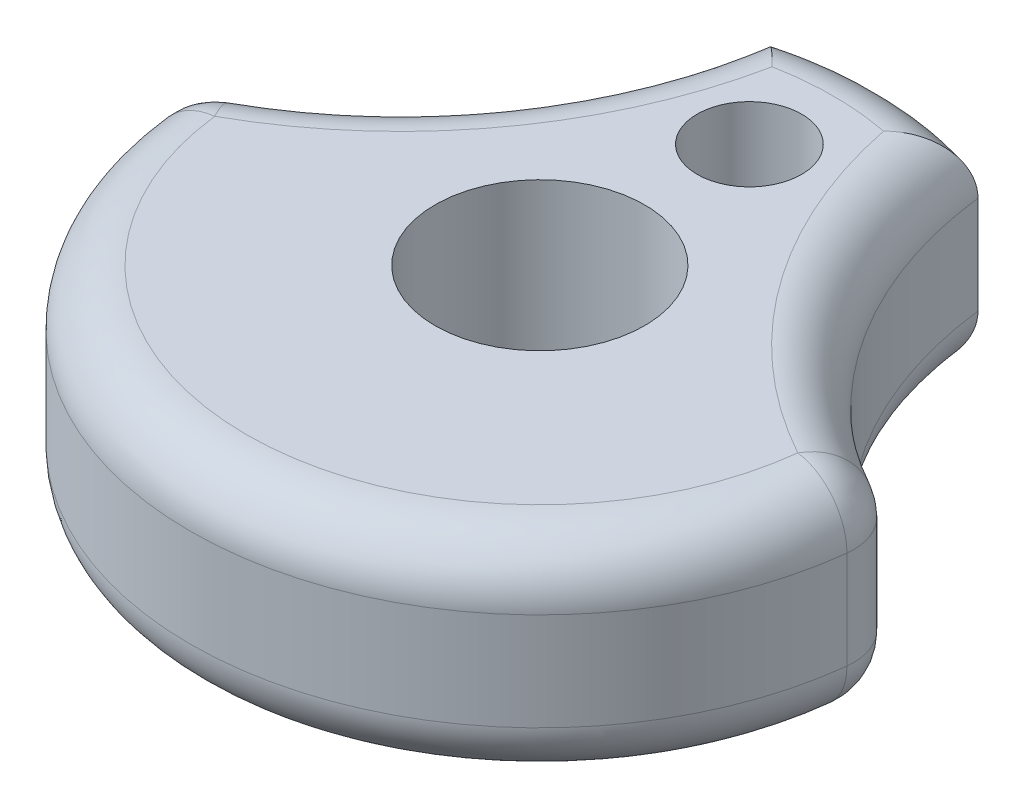
ISO-10303-21;
HEADER;
FILE_DESCRIPTION(('STEP AP214'),'2;1');
FILE_NAME('part.step','',(''),(''),'','','');
FILE_SCHEMA(('AUTOMOTIVE_DESIGN { 1 0 10303 214 1 1 1 1 }'));
ENDSEC;
DATA;
#1=APPLICATION_CONTEXT('core data for automotive mechanical design processes');
#2=APPLICATION_PROTOCOL_DEFINITION('international standard','automotive_design',2000,#1);
#3=PRODUCT_CONTEXT('',#1,'mechanical');
#4=PRODUCT('Part','Part','',(#3));
#5=PRODUCT_RELATED_PRODUCT_CATEGORY('part','',(#4));
#6=PRODUCT_DEFINITION_FORMATION('','',#4);
#7=PRODUCT_DEFINITION_CONTEXT('part definition',#1,'design');
#8=PRODUCT_DEFINITION('design','',#6,#7);
#9=PRODUCT_DEFINITION_SHAPE('','',#8);
#10=(LENGTH_UNIT() NAMED_UNIT(*) SI_UNIT(.MILLI.,.METRE.));
#11=(NAMED_UNIT(*) PLANE_ANGLE_UNIT() SI_UNIT($,.RADIAN.));
#12=(NAMED_UNIT(*) SI_UNIT($,.STERADIAN.) SOLID_ANGLE_UNIT());
#13=UNCERTAINTY_MEASURE_WITH_UNIT(LENGTH_MEASURE(1.E-05),#10,'distance_accuracy_value','');
#14=(GEOMETRIC_REPRESENTATION_CONTEXT(3) GLOBAL_UNCERTAINTY_ASSIGNED_CONTEXT((#13)) GLOBAL_UNIT_ASSIGNED_CONTEXT((#10,
#11,#12)) REPRESENTATION_CONTEXT('',''));
#15=CARTESIAN_POINT('',(0.,0.,0.));
#16=DIRECTION('',(0.,0.,1.));
#17=DIRECTION('',(1.,0.,0.));
#18=AXIS2_PLACEMENT_3D('',#15,#16,#17);
#19=CARTESIAN_POINT('',(0.,9.52499999999992,0.));
#20=DIRECTION('',(0.,-0.999999999999986,0.));
#21=DIRECTION('',(0.,0.,-1.00000000000001));
#22=AXIS2_PLACEMENT_3D('',#19,#20,#21);
#23=CYLINDRICAL_SURFACE('',#22,15.875);
#24=DIRECTION('',(0.,-0.999999999999986,0.));
#25=VECTOR('',#24,1.);
#26=CARTESIAN_POINT('',(-4.77520000000065,9.52499999999994,-15.1397850037574));
#27=LINE('',#26,#25);
#28=CARTESIAN_POINT('',(-4.77520000000069,6.98499999999994,-15.1397850037574));
#29=VERTEX_POINT('',#28);
#30=CARTESIAN_POINT('',(-4.77520000000063,2.53999999999993,-15.1397850037574));
#31=VERTEX_POINT('',#30);
#32=EDGE_CURVE('E157',#29,#31,#27,.T.);
#33=ORIENTED_EDGE('',*,*,#32,.F.);
#34=CARTESIAN_POINT('',(0.,6.98499999999992,0.));
#35=DIRECTION('',(0.,-0.999999999999986,0.));
#36=DIRECTION('',(0.,0.,-1.00000000000001));
#37=AXIS2_PLACEMENT_3D('',#34,#35,#36);
#38=CIRCLE('',#37,15.875);
#39=CARTESIAN_POINT('',(4.77519999999991,6.98499999999994,-15.1397850037575));
#40=VERTEX_POINT('',#39);
#41=EDGE_CURVE('E142',#29,#40,#38,.T.);
#42=ORIENTED_EDGE('',*,*,#41,.T.);
#43=DIRECTION('',(0.,-0.999999999999986,0.));
#44=VECTOR('',#43,1.);
#45=CARTESIAN_POINT('',(4.77519999999991,9.52499999999994,-15.1397850037575));
#46=LINE('',#45,#44);
#47=CARTESIAN_POINT('',(4.77519999999992,2.53999999999993,-15.1397850037575));
#48=VERTEX_POINT('',#47);
#49=EDGE_CURVE('E329',#40,#48,#46,.T.);
#50=ORIENTED_EDGE('',*,*,#49,.T.);
#51=CARTESIAN_POINT('',(0.,2.53999999999993,0.));
#52=DIRECTION('',(0.,-0.999999999999986,0.));
#53=DIRECTION('',(0.,0.,-1.00000000000001));
#54=AXIS2_PLACEMENT_3D('',#51,#52,#53);
#55=CIRCLE('',#54,15.875);
#56=EDGE_CURVE('E169',#48,#31,#55,.F.);
#57=ORIENTED_EDGE('',*,*,#56,.T.);
#58=EDGE_LOOP('',(#33,#42,#50,#57));
#59=FACE_BOUND('',#58,.T.);
#60=ADVANCED_FACE('F52',(#59),#23,.T.);
#61=CARTESIAN_POINT('',(-23.694038383807,9.52499999999922,-17.3713885096317));
#62=DIRECTION('',(0.,-0.999999999999986,0.));
#63=DIRECTION('',(0.,0.,-1.00000000000001));
#64=AXIS2_PLACEMENT_3D('',#61,#62,#63);
#65=CYLINDRICAL_SURFACE('',#64,19.0500000000001);
#66=DIRECTION('',(0.,-0.999999999999986,0.));
#67=VECTOR('',#66,1.);
#68=CARTESIAN_POINT('',(-14.4767061101796,9.52499999999992,-0.699757342959947));
#69=LINE('',#68,#67);
#70=CARTESIAN_POINT('',(-14.4767061101796,2.53999999999993,-0.699757342960017));
#71=VERTEX_POINT('',#70);
#72=CARTESIAN_POINT('',(-14.4767061101796,6.98499999999992,-0.699757342960003));
#73=VERTEX_POINT('',#72);
#74=EDGE_CURVE('E193',#71,#73,#69,.F.);
#75=ORIENTED_EDGE('',*,*,#74,.T.);
#76=CARTESIAN_POINT('',(-23.694038383807,6.98499999999921,-17.3713885096317));
#77=DIRECTION('',(0.,-0.999999999999986,0.));
#78=DIRECTION('',(0.,0.,-1.00000000000001));
#79=AXIS2_PLACEMENT_3D('',#76,#77,#78);
#80=CIRCLE('',#79,19.0500000000001);
#81=EDGE_CURVE('E196',#73,#29,#80,.F.);
#82=ORIENTED_EDGE('',*,*,#81,.T.);
#83=ORIENTED_EDGE('',*,*,#32,.T.);
#84=CARTESIAN_POINT('',(-23.694038383807,2.53999999999921,-17.3713885096317));
#85=DIRECTION('',(0.,-0.999999999999986,0.));
#86=DIRECTION('',(0.,0.,-1.00000000000001));
#87=AXIS2_PLACEMENT_3D('',#84,#85,#86);
#88=CIRCLE('',#87,19.0500000000001);
#89=EDGE_CURVE('E190',#31,#71,#88,.T.);
#90=ORIENTED_EDGE('',*,*,#89,.T.);
#91=EDGE_LOOP('',(#75,#82,#83,#90));
#92=FACE_BOUND('',#91,.T.);
#93=ADVANCED_FACE('F378',(#92),#65,.F.);
#94=CARTESIAN_POINT('',(0.,9.52499999999992,0.));
#95=DIRECTION('',(0.,-0.999999999999986,0.));
#96=DIRECTION('',(0.,0.,-1.00000000000001));
#97=AXIS2_PLACEMENT_3D('',#94,#95,#96);
#98=CYLINDRICAL_SURFACE('',#97,15.875);
#99=CARTESIAN_POINT('',(0.,6.98499999999992,0.));
#100=DIRECTION('',(0.,-0.999999999999986,0.));
#101=DIRECTION('',(0.,0.,-1.00000000000001));
#102=AXIS2_PLACEMENT_3D('',#99,#100,#101);
#103=CIRCLE('',#102,15.875);
#104=CARTESIAN_POINT('',(15.7711053258272,6.98499999999992,1.81324620547196));
#105=VERTEX_POINT('',#104);
#106=CARTESIAN_POINT('',(-15.7711053258284,6.98499999999992,1.81324620547187));
#107=VERTEX_POINT('',#106);
#108=EDGE_CURVE('E183',#105,#107,#103,.T.);
#109=ORIENTED_EDGE('',*,*,#108,.T.);
#110=DIRECTION('',(0.,-0.999999999999986,0.));
#111=VECTOR('',#110,1.);
#112=CARTESIAN_POINT('',(-15.7711053258284,9.52499999999992,1.81324620547189));
#113=LINE('',#112,#111);
#114=CARTESIAN_POINT('',(-15.7711053258284,2.53999999999993,1.8132462054718));
#115=VERTEX_POINT('',#114);
#116=EDGE_CURVE('E186',#107,#115,#113,.T.);
#117=ORIENTED_EDGE('',*,*,#116,.T.);
#118=CARTESIAN_POINT('',(0.,2.53999999999993,0.));
#119=DIRECTION('',(0.,-0.999999999999986,0.));
#120=DIRECTION('',(0.,0.,-1.00000000000001));
#121=AXIS2_PLACEMENT_3D('',#118,#119,#120);
#122=CIRCLE('',#121,15.875);
#123=CARTESIAN_POINT('',(15.7711053258272,2.53999999999993,1.81324620547196));
#124=VERTEX_POINT('',#123);
#125=EDGE_CURVE('E180',#115,#124,#122,.F.);
#126=ORIENTED_EDGE('',*,*,#125,.T.);
#127=DIRECTION('',(0.,-0.999999999999986,0.));
#128=VECTOR('',#127,1.);
#129=CARTESIAN_POINT('',(15.7711053258272,9.52499999999992,1.81324620547196));
#130=LINE('',#129,#128);
#131=EDGE_CURVE('E177',#124,#105,#130,.F.);
#132=ORIENTED_EDGE('',*,*,#131,.T.);
#133=EDGE_LOOP('',(#109,#117,#126,#132));
#134=FACE_BOUND('',#133,.T.);
#135=ADVANCED_FACE('F382',(#134),#98,.T.);
#136=CARTESIAN_POINT('',(23.6940383838059,9.52499999999994,-17.3713885096319));
#137=DIRECTION('',(0.,-0.999999999999986,0.));
#138=DIRECTION('',(0.,0.,-1.00000000000001));
#139=AXIS2_PLACEMENT_3D('',#136,#137,#138);
#140=CYLINDRICAL_SURFACE('',#139,19.0500000000001);
#141=DIRECTION('',(0.,-0.999999999999986,0.));
#142=VECTOR('',#141,1.);
#143=CARTESIAN_POINT('',(14.4767061101782,9.52499999999992,-0.69975734295992));
#144=LINE('',#143,#142);
#145=CARTESIAN_POINT('',(14.4767061101782,6.98499999999992,-0.699757342959934));
#146=VERTEX_POINT('',#145);
#147=CARTESIAN_POINT('',(14.4767061101782,2.53999999999993,-0.699757342959934));
#148=VERTEX_POINT('',#147);
#149=EDGE_CURVE('E68',#146,#148,#144,.T.);
#150=ORIENTED_EDGE('',*,*,#149,.T.);
#151=CARTESIAN_POINT('',(23.6940383838059,2.53999999999993,-17.3713885096318));
#152=DIRECTION('',(0.,-0.999999999999986,0.));
#153=DIRECTION('',(0.,0.,-1.00000000000001));
#154=AXIS2_PLACEMENT_3D('',#151,#152,#153);
#155=CIRCLE('',#154,19.0500000000001);
#156=EDGE_CURVE('E13',#148,#48,#155,.T.);
#157=ORIENTED_EDGE('',*,*,#156,.T.);
#158=ORIENTED_EDGE('',*,*,#49,.F.);
#159=CARTESIAN_POINT('',(23.6940383838059,6.98499999999994,-17.3713885096319));
#160=DIRECTION('',(0.,-0.999999999999986,0.));
#161=DIRECTION('',(0.,0.,-1.00000000000001));
#162=AXIS2_PLACEMENT_3D('',#159,#160,#161);
#163=CIRCLE('',#162,19.0500000000001);
#164=EDGE_CURVE('E79',#40,#146,#163,.F.);
#165=ORIENTED_EDGE('',*,*,#164,.T.);
#166=EDGE_LOOP('',(#150,#157,#158,#165));
#167=FACE_BOUND('',#166,.T.);
#168=ADVANCED_FACE('F332',(#167),#140,.F.);
#169=CARTESIAN_POINT('',(11.8470191919029,9.52499999999994,-8.68569425481596));
#170=DIRECTION('',(0.,-0.999999999999986,0.));
#171=DIRECTION('',(0.,0.,-1.00000000000001));
#172=AXIS2_PLACEMENT_3D('',#169,#170,#171);
#173=PLANE('',#172);
#174=CARTESIAN_POINT('',(0.,9.52499999999992,0.));
#175=DIRECTION('',(0.,-0.999999999999986,0.));
#176=DIRECTION('',(0.,0.,-1.00000000000001));
#177=AXIS2_PLACEMENT_3D('',#174,#175,#176);
#178=CIRCLE('',#177,13.335);
#179=CARTESIAN_POINT('',(-13.2477284736959,9.52499999999992,1.52312681259636));
#180=VERTEX_POINT('',#179);
#181=CARTESIAN_POINT('',(13.2477284736949,9.52499999999992,1.52312681259641));
#182=VERTEX_POINT('',#181);
#183=EDGE_CURVE('E156',#180,#182,#178,.F.);
#184=ORIENTED_EDGE('',*,*,#183,.T.);
#185=CARTESIAN_POINT('',(23.6940383838059,9.52499999999994,-17.3713885096319));
#186=DIRECTION('',(0.,-0.999999999999986,0.));
#187=DIRECTION('',(0.,0.,-1.00000000000001));
#188=AXIS2_PLACEMENT_3D('',#185,#186,#187);
#189=CIRCLE('',#188,21.59);
#190=CARTESIAN_POINT('',(2.53233011221485,9.52499999999994,-13.0923462069552));
#191=VERTEX_POINT('',#190);
#192=EDGE_CURVE('E162',#182,#191,#189,.T.);
#193=ORIENTED_EDGE('',*,*,#192,.T.);
#194=CARTESIAN_POINT('',(0.,9.52499999999992,0.));
#195=DIRECTION('',(0.,-0.999999999999986,0.));
#196=DIRECTION('',(0.,0.,-1.00000000000001));
#197=AXIS2_PLACEMENT_3D('',#194,#195,#196);
#198=CIRCLE('',#197,13.335);
#199=CARTESIAN_POINT('',(-2.53233011221624,9.52499999999994,-13.0923462069551));
#200=VERTEX_POINT('',#199);
#201=EDGE_CURVE('E140',#191,#200,#198,.F.);
#202=ORIENTED_EDGE('',*,*,#201,.T.);
#203=CARTESIAN_POINT('',(-23.694038383807,9.52499999999922,-17.3713885096317));
#204=DIRECTION('',(0.,-0.999999999999986,0.));
#205=DIRECTION('',(0.,0.,-1.00000000000001));
#206=AXIS2_PLACEMENT_3D('',#203,#204,#205);
#207=CIRCLE('',#206,21.5900000000001);
#208=EDGE_CURVE('E149',#200,#180,#207,.T.);
#209=ORIENTED_EDGE('',*,*,#208,.T.);
#210=EDGE_LOOP('',(#184,#193,#202,#209));
#211=FACE_BOUND('',#210,.T.);
#212=CARTESIAN_POINT('',(0.,9.52499999999992,0.));
#213=DIRECTION('',(0.,0.999999999999986,0.));
#214=DIRECTION('',(0.,0.,1.00000000000001));
#215=AXIS2_PLACEMENT_3D('',#212,#213,#214);
#216=CIRCLE('',#215,4.7625);
#217=CARTESIAN_POINT('',(0.,9.52499999999992,4.76250000000004));
#218=VERTEX_POINT('',#217);
#219=EDGE_CURVE('E341',#218,#218,#216,.T.);
#220=ORIENTED_EDGE('',*,*,#219,.F.);
#221=EDGE_LOOP('',(#220));
#222=FACE_BOUND('',#221,.T.);
#223=CARTESIAN_POINT('',(-6.52256026967279E-13,9.52499999999994,-9.52500000000028));
#224=DIRECTION('',(0.,0.999999999999986,0.));
#225=DIRECTION('',(0.,0.,1.00000000000001));
#226=AXIS2_PLACEMENT_3D('',#223,#224,#225);
#227=CIRCLE('',#226,2.3749);
#228=CARTESIAN_POINT('',(-6.54365361896225E-13,9.52499999999994,-7.15010000000026));
#229=VERTEX_POINT('',#228);
#230=EDGE_CURVE('E344',#229,#229,#227,.T.);
#231=ORIENTED_EDGE('',*,*,#230,.F.);
#232=EDGE_LOOP('',(#231));
#233=FACE_BOUND('',#232,.T.);
#234=ADVANCED_FACE('F159',(#211,#222,#233),#173,.F.);
#235=CARTESIAN_POINT('',(11.8470191919029,0.,-8.68569425481602));
#236=DIRECTION('',(0.,-0.999999999999986,0.));
#237=DIRECTION('',(0.,0.,-1.00000000000001));
#238=AXIS2_PLACEMENT_3D('',#235,#236,#237);
#239=PLANE('',#238);
#240=CARTESIAN_POINT('',(23.6940383838059,0.,-17.3713885096318));
#241=DIRECTION('',(0.,-0.999999999999986,0.));
#242=DIRECTION('',(0.,0.,-1.00000000000001));
#243=AXIS2_PLACEMENT_3D('',#240,#241,#242);
#244=CIRCLE('',#243,21.59);
#245=CARTESIAN_POINT('',(2.53233011221475,0.,-13.0923462069553));
#246=VERTEX_POINT('',#245);
#247=CARTESIAN_POINT('',(13.2477284736949,0.,1.52312681259641));
#248=VERTEX_POINT('',#247);
#249=EDGE_CURVE('E205',#246,#248,#244,.F.);
#250=ORIENTED_EDGE('',*,*,#249,.T.);
#251=CARTESIAN_POINT('',(0.,0.,0.));
#252=DIRECTION('',(0.,-0.999999999999986,0.));
#253=DIRECTION('',(0.,0.,-1.00000000000001));
#254=AXIS2_PLACEMENT_3D('',#251,#252,#253);
#255=CIRCLE('',#254,13.335);
#256=CARTESIAN_POINT('',(-13.2477284736959,0.,1.52312681259631));
#257=VERTEX_POINT('',#256);
#258=EDGE_CURVE('E208',#248,#257,#255,.T.);
#259=ORIENTED_EDGE('',*,*,#258,.T.);
#260=CARTESIAN_POINT('',(-23.694038383807,-7.91033905045424E-13,-17.3713885096317));
#261=DIRECTION('',(0.,-0.999999999999986,0.));
#262=DIRECTION('',(0.,0.,-1.00000000000001));
#263=AXIS2_PLACEMENT_3D('',#260,#261,#262);
#264=CIRCLE('',#263,21.5900000000001);
#265=CARTESIAN_POINT('',(-2.53233011221626,0.,-13.0923462069551));
#266=VERTEX_POINT('',#265);
#267=EDGE_CURVE('E202',#257,#266,#264,.F.);
#268=ORIENTED_EDGE('',*,*,#267,.T.);
#269=CARTESIAN_POINT('',(0.,0.,0.));
#270=DIRECTION('',(0.,-0.999999999999986,0.));
#271=DIRECTION('',(0.,0.,-1.00000000000001));
#272=AXIS2_PLACEMENT_3D('',#269,#270,#271);
#273=CIRCLE('',#272,13.335);
#274=EDGE_CURVE('E199',#266,#246,#273,.T.);
#275=ORIENTED_EDGE('',*,*,#274,.T.);
#276=EDGE_LOOP('',(#250,#259,#268,#275));
#277=FACE_BOUND('',#276,.T.);
#278=CARTESIAN_POINT('',(0.,0.,0.));
#279=DIRECTION('',(0.,0.999999999999986,0.));
#280=DIRECTION('',(0.,0.,1.00000000000001));
#281=AXIS2_PLACEMENT_3D('',#278,#279,#280);
#282=CIRCLE('',#281,4.7625);
#283=CARTESIAN_POINT('',(0.,0.,4.76250000000004));
#284=VERTEX_POINT('',#283);
#285=EDGE_CURVE('E334',#284,#284,#282,.T.);
#286=ORIENTED_EDGE('',*,*,#285,.T.);
#287=EDGE_LOOP('',(#286));
#288=FACE_BOUND('',#287,.T.);
#289=CARTESIAN_POINT('',(-7.07767178198537E-13,0.,-9.5250000000003));
#290=DIRECTION('',(0.,0.999999999999986,0.));
#291=DIRECTION('',(0.,0.,1.00000000000001));
#292=AXIS2_PLACEMENT_3D('',#289,#290,#291);
#293=CIRCLE('',#292,2.3749);
#294=CARTESIAN_POINT('',(-7.09876513127483E-13,0.,-7.15010000000028));
#295=VERTEX_POINT('',#294);
#296=EDGE_CURVE('E348',#295,#295,#293,.T.);
#297=ORIENTED_EDGE('',*,*,#296,.T.);
#298=EDGE_LOOP('',(#297));
#299=FACE_BOUND('',#298,.T.);
#300=ADVANCED_FACE('F360',(#277,#288,#299),#239,.T.);
#301=CARTESIAN_POINT('',(-7.07767178198537E-13,0.,-9.5250000000003));
#302=DIRECTION('',(0.,0.999999999999986,0.));
#303=DIRECTION('',(0.,0.,1.00000000000001));
#304=AXIS2_PLACEMENT_3D('',#301,#302,#303);
#305=CYLINDRICAL_SURFACE('',#304,2.3749);
#306=ORIENTED_EDGE('',*,*,#296,.F.);
#307=EDGE_LOOP('',(#306));
#308=FACE_BOUND('',#307,.T.);
#309=ORIENTED_EDGE('',*,*,#230,.T.);
#310=EDGE_LOOP('',(#309));
#311=FACE_BOUND('',#310,.T.);
#312=ADVANCED_FACE('F364',(#308,#311),#305,.F.);
#313=CARTESIAN_POINT('',(0.,0.,0.));
#314=DIRECTION('',(0.,0.999999999999986,0.));
#315=DIRECTION('',(0.,0.,1.00000000000001));
#316=AXIS2_PLACEMENT_3D('',#313,#314,#315);
#317=CYLINDRICAL_SURFACE('',#316,4.7625);
#318=ORIENTED_EDGE('',*,*,#285,.F.);
#319=EDGE_LOOP('',(#318));
#320=FACE_BOUND('',#319,.T.);
#321=ORIENTED_EDGE('',*,*,#219,.T.);
#322=EDGE_LOOP('',(#321));
#323=FACE_BOUND('',#322,.T.);
#324=ADVANCED_FACE('F357',(#320,#323),#317,.F.);
#325=CARTESIAN_POINT('',(0.,2.53999999999993,0.));
#326=DIRECTION('',(0.,-0.999999999999986,0.));
#327=DIRECTION('',(0.,0.,-1.00000000000001));
#328=AXIS2_PLACEMENT_3D('',#325,#326,#327);
#329=TOROIDAL_SURFACE('',#328,13.335,2.54);
#330=CARTESIAN_POINT('',(-4.77520000000063,2.53999999999993,-15.1397850037574));
#331=CARTESIAN_POINT('',(-4.7752115681027,2.47673757971989,-15.1397925817919));
#332=CARTESIAN_POINT('',(-4.77303212651508,2.41348206706651,-15.137990844844));
#333=CARTESIAN_POINT('',(-4.76437952419348,2.28749211304523,-15.1308272346097));
#334=CARTESIAN_POINT('',(-4.75790802966761,2.22475747903354,-15.1254667428586));
#335=CARTESIAN_POINT('',(-4.74080082310117,2.10056671923542,-15.111278309703));
#336=CARTESIAN_POINT('',(-4.73018533268716,2.03910588855534,-15.1024672057344));
#337=CARTESIAN_POINT('',(-4.70496145064844,1.91760672090129,-15.0814921089138));
#338=CARTESIAN_POINT('',(-4.69035284063128,1.85756846192609,-15.0693279326746));
#339=CARTESIAN_POINT('',(-4.64086975762556,1.68034424888241,-15.028030756822));
#340=CARTESIAN_POINT('',(-4.60030141536865,1.56579071926105,-14.9940630078743));
#341=CARTESIAN_POINT('',(-4.50606755528109,1.34649862068164,-14.914621298062));
#342=CARTESIAN_POINT('',(-4.45238879811969,1.24177012226854,-14.8691357043785));
#343=CARTESIAN_POINT('',(-4.33077187826603,1.03804713870841,-14.7652264100579));
#344=CARTESIAN_POINT('',(-4.26218054288056,0.939752612170806,-14.7061989156937));
#345=CARTESIAN_POINT('',(-4.1156094784035,0.757346646354031,-14.5787875318001));
#346=CARTESIAN_POINT('',(-4.03762792206651,0.673237975172881,-14.5104018208987));
#347=CARTESIAN_POINT('',(-3.86240649099919,0.508186056447375,-14.3550240109159));
#348=CARTESIAN_POINT('',(-3.76403458199882,0.429624563991564,-14.2667806230603));
#349=CARTESIAN_POINT('',(-3.56114131149264,0.292194065485533,-14.0822304123781));
#350=CARTESIAN_POINT('',(-3.45661184109685,0.233351741504959,-13.9859128828092));
#351=CARTESIAN_POINT('',(-3.21762758553423,0.123136513488361,-13.762444538317));
#352=CARTESIAN_POINT('',(-3.08221037557047,0.0772851339182793,-13.6335942502445));
#353=CARTESIAN_POINT('',(-2.81058884478843,0.0160285730848551,-13.3701206503412));
#354=CARTESIAN_POINT('',(-2.67438675848117,0.000560005763139344,-13.2355099573205));
#355=CARTESIAN_POINT('',(-2.53725085829122,4.97156828358372E-06,-13.0973078667762));
#356=CARTESIAN_POINT('',(-2.53479022392765,-5.56000707119285E-09,-13.0948272166039));
#357=CARTESIAN_POINT('',(-2.53233011221626,0.,-13.0923462069551));
#358=B_SPLINE_CURVE_WITH_KNOTS('',3,(#330,#331,#332,#333,#334,#335,#336,#337,#338,#339,#340,
#341,#342,#343,#344,#345,#346,#347,#348,#349,#350,#351,#352,#353,#354,#355,#356,#357),
.UNSPECIFIED.,.F.,.F.,(4,2,2,2,2,2,2,2,2,2,2,2,2,4),(0.,0.189712597385781,0.379351589950103,
0.568076533796611,0.756811801489067,1.1335050746598,1.51058032948186,1.90984235734389,
2.30918220363494,2.76862657203211,3.22869012933078,3.80347651116085,4.37706246741555,
4.38754459436623),.UNSPECIFIED.);
#359=EDGE_CURVE('E272',#31,#266,#358,.T.);
#360=ORIENTED_EDGE('',*,*,#359,.F.);
#361=ORIENTED_EDGE('',*,*,#56,.F.);
#362=CARTESIAN_POINT('',(4.77519999999992,2.53999999999993,-15.1397850037575));
#363=CARTESIAN_POINT('',(4.77521156810171,2.47673757971991,-15.1397925817922));
#364=CARTESIAN_POINT('',(4.773032126514,2.41348206706654,-15.1379908448443));
#365=CARTESIAN_POINT('',(4.76437952419232,2.28749211304528,-15.1308272346101));
#366=CARTESIAN_POINT('',(4.75790802966648,2.22475747903359,-15.125466742859));
#367=CARTESIAN_POINT('',(4.74080082309995,2.10056671923547,-15.1112783097034));
#368=CARTESIAN_POINT('',(4.73018533268584,2.03910588855539,-15.1024672057349));
#369=CARTESIAN_POINT('',(4.70496145064729,1.91760672090131,-15.0814921089141));
#370=CARTESIAN_POINT('',(4.69035284063042,1.85756846192609,-15.0693279326746));
#371=CARTESIAN_POINT('',(4.64086975762488,1.68034424888244,-15.0280307568219));
#372=CARTESIAN_POINT('',(4.60030141536723,1.56579071926119,-14.9940630078747));
#373=CARTESIAN_POINT('',(4.50606755527977,1.34649862068175,-14.9146212980625));
#374=CARTESIAN_POINT('',(4.45238879811921,1.24177012226849,-14.8691357043784));
#375=CARTESIAN_POINT('',(4.33077187826551,1.03804713870843,-14.7652264100579));
#376=CARTESIAN_POINT('',(4.26218054287906,0.93975261217106,-14.7061989156944));
#377=CARTESIAN_POINT('',(4.11560947840192,0.757346646354289,-14.5787875318007));
#378=CARTESIAN_POINT('',(4.03762792206581,0.673237975172905,-14.5104018208985));
#379=CARTESIAN_POINT('',(3.86240649099839,0.508186056447358,-14.3550240109159));
#380=CARTESIAN_POINT('',(3.76403458199673,0.429624563991808,-14.2667806230614));
#381=CARTESIAN_POINT('',(3.56114131149081,0.292194065485793,-14.0822304123789));
#382=CARTESIAN_POINT('',(3.45661184109658,0.233351741504965,-13.9859128828086));
#383=CARTESIAN_POINT('',(3.2176275855326,0.12313651348834,-13.7624445383179));
#384=CARTESIAN_POINT('',(3.08221037556472,0.0772851339186327,-13.6335942502495));
#385=CARTESIAN_POINT('',(2.8105888447873,0.0160285730852096,-13.3701206503414));
#386=CARTESIAN_POINT('',(2.67438675848875,0.000560005763145669,-13.2355099573119));
#387=CARTESIAN_POINT('',(2.53725085829007,4.97156828340295E-06,-13.0973078667761));
#388=CARTESIAN_POINT('',(2.53479022392633,-5.56000725333816E-09,-13.0948272166039));
#389=CARTESIAN_POINT('',(2.53233011221475,0.,-13.0923462069553));
#390=B_SPLINE_CURVE_WITH_KNOTS('',3,(#362,#363,#364,#365,#366,#367,#368,#369,#370,#371,#372,
#373,#374,#375,#376,#377,#378,#379,#380,#381,#382,#383,#384,#385,#386,#387,#388,#389),
.UNSPECIFIED.,.F.,.F.,(4,2,2,2,2,2,2,2,2,2,2,2,2,4),(0.,0.189712597385736,0.379351589950058,
0.568076533796599,0.756811801489063,1.13350507465973,1.51058032948169,1.90984235734376,
2.30918220363493,2.76862657203218,3.2286901293307,3.80347651116072,4.37706246741581,
4.38754459436656),.UNSPECIFIED.);
#391=EDGE_CURVE('E57',#246,#48,#390,.F.);
#392=ORIENTED_EDGE('',*,*,#391,.F.);
#393=ORIENTED_EDGE('',*,*,#274,.F.);
#394=EDGE_LOOP('',(#360,#361,#392,#393));
#395=FACE_BOUND('',#394,.T.);
#396=ADVANCED_FACE('F270',(#395),#329,.T.);
#397=CARTESIAN_POINT('',(23.6940383838059,2.53999999999993,-17.3713885096318));
#398=DIRECTION('',(0.,-0.999999999999986,0.));
#399=DIRECTION('',(0.,0.,-1.00000000000001));
#400=AXIS2_PLACEMENT_3D('',#397,#398,#399);
#401=TOROIDAL_SURFACE('',#400,21.59,2.54);
#402=ORIENTED_EDGE('',*,*,#391,.T.);
#403=ORIENTED_EDGE('',*,*,#156,.F.);
#404=CARTESIAN_POINT('',(13.2477284736949,2.53999999999993,1.52312681259641));
#405=DIRECTION('',(0.875151242345005,0.,0.483849463182536));
#406=DIRECTION('',(0.483849463182544,0.,-0.875151242344993));
#407=AXIS2_PLACEMENT_3D('',#404,#405,#406);
#408=CIRCLE('',#407,2.54);
#409=EDGE_CURVE('E280',#248,#148,#408,.T.);
#410=ORIENTED_EDGE('',*,*,#409,.F.);
#411=ORIENTED_EDGE('',*,*,#249,.F.);
#412=EDGE_LOOP('',(#402,#403,#410,#411));
#413=FACE_BOUND('',#412,.T.);
#414=ADVANCED_FACE('F54',(#413),#401,.T.);
#415=CARTESIAN_POINT('',(0.,2.53999999999993,0.));
#416=DIRECTION('',(0.,-0.999999999999986,0.));
#417=DIRECTION('',(0.,0.,-1.00000000000001));
#418=AXIS2_PLACEMENT_3D('',#415,#416,#417);
#419=TOROIDAL_SURFACE('',#418,13.335,2.54);
#420=CARTESIAN_POINT('',(-13.2477284736959,2.53999999999993,1.52312681259631));
#421=DIRECTION('',(-0.114220233415552,0.,-0.993455453595433));
#422=DIRECTION('',(-0.99345545359545,0.,0.114220233415553));
#423=AXIS2_PLACEMENT_3D('',#420,#421,#422);
#424=CIRCLE('',#423,2.54);
#425=EDGE_CURVE('E288',#257,#115,#424,.T.);
#426=ORIENTED_EDGE('',*,*,#425,.F.);
#427=ORIENTED_EDGE('',*,*,#258,.F.);
#428=CARTESIAN_POINT('',(13.247728473695,2.53999999999993,1.52312681259646));
#429=DIRECTION('',(0.114220233415553,0.,-0.993455453595436));
#430=DIRECTION('',(-0.99345545359545,0.,-0.114220233415549));
#431=AXIS2_PLACEMENT_3D('',#428,#429,#430);
#432=CIRCLE('',#431,2.54);
#433=EDGE_CURVE('E284',#124,#248,#432,.T.);
#434=ORIENTED_EDGE('',*,*,#433,.F.);
#435=ORIENTED_EDGE('',*,*,#125,.F.);
#436=EDGE_LOOP('',(#426,#427,#434,#435));
#437=FACE_BOUND('',#436,.T.);
#438=ADVANCED_FACE('F268',(#437),#419,.T.);
#439=CARTESIAN_POINT('',(-23.694038383807,2.53999999999921,-17.3713885096317));
#440=DIRECTION('',(0.,-0.999999999999986,0.));
#441=DIRECTION('',(0.,0.,-1.00000000000001));
#442=AXIS2_PLACEMENT_3D('',#439,#440,#441);
#443=TOROIDAL_SURFACE('',#442,21.5900000000001,2.54);
#444=ORIENTED_EDGE('',*,*,#359,.T.);
#445=ORIENTED_EDGE('',*,*,#267,.F.);
#446=CARTESIAN_POINT('',(-13.2477284736959,2.53999999999993,1.52312681259631));
#447=DIRECTION('',(-0.875151242345007,0.,0.483849463182537));
#448=DIRECTION('',(0.483849463182543,0.,0.875151242344994));
#449=AXIS2_PLACEMENT_3D('',#446,#447,#448);
#450=CIRCLE('',#449,2.54);
#451=EDGE_CURVE('E292',#71,#257,#450,.T.);
#452=ORIENTED_EDGE('',*,*,#451,.F.);
#453=ORIENTED_EDGE('',*,*,#89,.F.);
#454=EDGE_LOOP('',(#444,#445,#452,#453));
#455=FACE_BOUND('',#454,.T.);
#456=ADVANCED_FACE('F264',(#455),#443,.T.);
#457=CARTESIAN_POINT('',(13.2477284736949,2.53999999999993,1.52312681259641));
#458=DIRECTION('',(0.,-0.999999999999986,0.));
#459=DIRECTION('',(1.00000000000002,0.,0.));
#460=AXIS2_PLACEMENT_3D('',#457,#458,#459);
#461=SPHERICAL_SURFACE('',#460,2.54);
#462=ORIENTED_EDGE('',*,*,#433,.T.);
#463=ORIENTED_EDGE('',*,*,#409,.T.);
#464=CARTESIAN_POINT('',(13.2477284736949,2.53999999999993,1.52312681259641));
#465=DIRECTION('',(0.,-0.999999999999986,0.));
#466=DIRECTION('',(0.,0.,-1.00000000000001));
#467=AXIS2_PLACEMENT_3D('',#464,#465,#466);
#468=CIRCLE('',#467,2.54);
#469=EDGE_CURVE('E295',#124,#148,#468,.F.);
#470=ORIENTED_EDGE('',*,*,#469,.F.);
#471=EDGE_LOOP('',(#462,#463,#470));
#472=FACE_BOUND('',#471,.T.);
#473=ADVANCED_FACE('F260',(#472),#461,.T.);
#474=CARTESIAN_POINT('',(-13.2477284736959,2.53999999999993,1.52312681259631));
#475=DIRECTION('',(0.,-0.999999999999986,0.));
#476=DIRECTION('',(1.00000000000002,0.,0.));
#477=AXIS2_PLACEMENT_3D('',#474,#475,#476);
#478=SPHERICAL_SURFACE('',#477,2.54);
#479=ORIENTED_EDGE('',*,*,#451,.T.);
#480=ORIENTED_EDGE('',*,*,#425,.T.);
#481=CARTESIAN_POINT('',(-13.2477284736959,2.53999999999993,1.52312681259631));
#482=DIRECTION('',(0.,-0.999999999999986,0.));
#483=DIRECTION('',(1.00000000000002,0.,0.));
#484=AXIS2_PLACEMENT_3D('',#481,#482,#483);
#485=CIRCLE('',#484,2.54);
#486=EDGE_CURVE('E299',#71,#115,#485,.F.);
#487=ORIENTED_EDGE('',*,*,#486,.F.);
#488=EDGE_LOOP('',(#479,#480,#487));
#489=FACE_BOUND('',#488,.T.);
#490=ADVANCED_FACE('F256',(#489),#478,.T.);
#491=CARTESIAN_POINT('',(13.2477284736949,9.52499999999992,1.52312681259641));
#492=DIRECTION('',(0.,0.999999999999986,0.));
#493=DIRECTION('',(0.,0.,1.00000000000001));
#494=AXIS2_PLACEMENT_3D('',#491,#492,#493);
#495=CYLINDRICAL_SURFACE('',#494,2.54);
#496=ORIENTED_EDGE('',*,*,#469,.T.);
#497=ORIENTED_EDGE('',*,*,#149,.F.);
#498=CARTESIAN_POINT('',(13.247728473695,6.98499999999992,1.52312681259646));
#499=DIRECTION('',(0.,0.999999999999986,0.));
#500=DIRECTION('',(0.,0.,1.00000000000001));
#501=AXIS2_PLACEMENT_3D('',#498,#499,#500);
#502=CIRCLE('',#501,2.54);
#503=EDGE_CURVE('E302',#105,#146,#502,.T.);
#504=ORIENTED_EDGE('',*,*,#503,.F.);
#505=ORIENTED_EDGE('',*,*,#131,.F.);
#506=EDGE_LOOP('',(#496,#497,#504,#505));
#507=FACE_BOUND('',#506,.T.);
#508=ADVANCED_FACE('F252',(#507),#495,.T.);
#509=CARTESIAN_POINT('',(0.,6.98499999999992,0.));
#510=DIRECTION('',(0.,-0.999999999999986,0.));
#511=DIRECTION('',(0.,0.,-1.00000000000001));
#512=AXIS2_PLACEMENT_3D('',#509,#510,#511);
#513=TOROIDAL_SURFACE('',#512,13.335,2.54);
#514=CARTESIAN_POINT('',(-13.2477284736959,6.98499999999992,1.52312681259632));
#515=DIRECTION('',(-0.114220233415552,0.,-0.993455453595436));
#516=DIRECTION('',(-0.99345545359545,0.,0.114220233415552));
#517=AXIS2_PLACEMENT_3D('',#514,#515,#516);
#518=CIRCLE('',#517,2.54);
#519=EDGE_CURVE('E310',#107,#180,#518,.T.);
#520=ORIENTED_EDGE('',*,*,#519,.F.);
#521=ORIENTED_EDGE('',*,*,#108,.F.);
#522=CARTESIAN_POINT('',(13.2477284736949,6.98499999999992,1.52312681259641));
#523=DIRECTION('',(0.114220233415552,0.,-0.993455453595435));
#524=DIRECTION('',(-0.993455453595449,0.,-0.114220233415548));
#525=AXIS2_PLACEMENT_3D('',#522,#523,#524);
#526=CIRCLE('',#525,2.54);
#527=EDGE_CURVE('E306',#182,#105,#526,.T.);
#528=ORIENTED_EDGE('',*,*,#527,.F.);
#529=ORIENTED_EDGE('',*,*,#183,.F.);
#530=EDGE_LOOP('',(#520,#521,#528,#529));
#531=FACE_BOUND('',#530,.T.);
#532=ADVANCED_FACE('F248',(#531),#513,.T.);
#533=CARTESIAN_POINT('',(-13.2477284736959,9.52499999999992,1.52312681259636));
#534=DIRECTION('',(0.,0.999999999999986,0.));
#535=DIRECTION('',(0.,0.,1.00000000000001));
#536=AXIS2_PLACEMENT_3D('',#533,#534,#535);
#537=CYLINDRICAL_SURFACE('',#536,2.54);
#538=ORIENTED_EDGE('',*,*,#486,.T.);
#539=ORIENTED_EDGE('',*,*,#116,.F.);
#540=CARTESIAN_POINT('',(-13.2477284736959,6.98499999999992,1.52312681259632));
#541=DIRECTION('',(0.,0.999999999999986,0.));
#542=DIRECTION('',(0.,0.,1.00000000000001));
#543=AXIS2_PLACEMENT_3D('',#540,#541,#542);
#544=CIRCLE('',#543,2.54);
#545=EDGE_CURVE('E314',#73,#107,#544,.T.);
#546=ORIENTED_EDGE('',*,*,#545,.F.);
#547=ORIENTED_EDGE('',*,*,#74,.F.);
#548=EDGE_LOOP('',(#538,#539,#546,#547));
#549=FACE_BOUND('',#548,.T.);
#550=ADVANCED_FACE('F244',(#549),#537,.T.);
#551=CARTESIAN_POINT('',(13.2477284736949,6.98499999999992,1.52312681259641));
#552=DIRECTION('',(0.,0.999999999999986,0.));
#553=DIRECTION('',(0.,0.,1.00000000000001));
#554=AXIS2_PLACEMENT_3D('',#551,#552,#553);
#555=SPHERICAL_SURFACE('',#554,2.54);
#556=ORIENTED_EDGE('',*,*,#527,.T.);
#557=ORIENTED_EDGE('',*,*,#503,.T.);
#558=CARTESIAN_POINT('',(13.2477284736949,6.98499999999992,1.52312681259641));
#559=DIRECTION('',(0.875151242345005,0.,0.483849463182536));
#560=DIRECTION('',(0.483849463182545,0.,-0.875151242344992));
#561=AXIS2_PLACEMENT_3D('',#558,#559,#560);
#562=CIRCLE('',#561,2.54);
#563=EDGE_CURVE('E318',#182,#146,#562,.F.);
#564=ORIENTED_EDGE('',*,*,#563,.F.);
#565=EDGE_LOOP('',(#556,#557,#564));
#566=FACE_BOUND('',#565,.T.);
#567=ADVANCED_FACE('F240',(#566),#555,.T.);
#568=CARTESIAN_POINT('',(-13.2477284736959,6.98499999999992,1.52312681259632));
#569=DIRECTION('',(0.,0.999999999999986,0.));
#570=DIRECTION('',(0.,0.,1.00000000000001));
#571=AXIS2_PLACEMENT_3D('',#568,#569,#570);
#572=SPHERICAL_SURFACE('',#571,2.54);
#573=ORIENTED_EDGE('',*,*,#545,.T.);
#574=ORIENTED_EDGE('',*,*,#519,.T.);
#575=CARTESIAN_POINT('',(-13.2477284736959,6.98499999999992,1.52312681259632));
#576=DIRECTION('',(-0.875151242345008,0.,0.483849463182537));
#577=DIRECTION('',(0.483849463182542,0.,0.875151242344993));
#578=AXIS2_PLACEMENT_3D('',#575,#576,#577);
#579=CIRCLE('',#578,2.54);
#580=EDGE_CURVE('E152',#73,#180,#579,.F.);
#581=ORIENTED_EDGE('',*,*,#580,.F.);
#582=EDGE_LOOP('',(#573,#574,#581));
#583=FACE_BOUND('',#582,.T.);
#584=ADVANCED_FACE('F236',(#583),#572,.T.);
#585=CARTESIAN_POINT('',(23.6940383838059,6.98499999999994,-17.3713885096319));
#586=DIRECTION('',(0.,-0.999999999999986,0.));
#587=DIRECTION('',(0.,0.,-1.00000000000001));
#588=AXIS2_PLACEMENT_3D('',#585,#586,#587);
#589=TOROIDAL_SURFACE('',#588,21.59,2.54);
#590=ORIENTED_EDGE('',*,*,#563,.T.);
#591=ORIENTED_EDGE('',*,*,#164,.F.);
#592=CARTESIAN_POINT('',(4.77519999999991,6.98499999999994,-15.1397850037575));
#593=CARTESIAN_POINT('',(4.7752115681017,7.04826242027995,-15.1397925817922));
#594=CARTESIAN_POINT('',(4.77303212651399,7.11151793293332,-15.1379908448443));
#595=CARTESIAN_POINT('',(4.76437952419231,7.23750788695458,-15.13082723461));
#596=CARTESIAN_POINT('',(4.75790802966647,7.30024252096628,-15.125466742859));
#597=CARTESIAN_POINT('',(4.74080082309995,7.4244332807644,-15.1112783097034));
#598=CARTESIAN_POINT('',(4.73018533268583,7.48589411144448,-15.1024672057349));
#599=CARTESIAN_POINT('',(4.70496145064728,7.60739327909856,-15.0814921089141));
#600=CARTESIAN_POINT('',(4.69035284063041,7.66743153807378,-15.0693279326747));
#601=CARTESIAN_POINT('',(4.64086975762487,7.84465575111743,-15.0280307568219));
#602=CARTESIAN_POINT('',(4.60030141536723,7.95920928073865,-14.9940630078747));
#603=CARTESIAN_POINT('',(4.50606755527978,8.1785013793181,-14.9146212980625));
#604=CARTESIAN_POINT('',(4.45238879811921,8.28322987773138,-14.8691357043785));
#605=CARTESIAN_POINT('',(4.3307718782655,8.4869528612914,-14.765226410058));
#606=CARTESIAN_POINT('',(4.26218054287905,8.58524738782871,-14.7061989156945));
#607=CARTESIAN_POINT('',(4.11560947840207,8.7676533536455,-14.5787875318008));
#608=CARTESIAN_POINT('',(4.03762792206611,8.85176202482698,-14.5104018208986));
#609=CARTESIAN_POINT('',(3.86240649099874,9.01681394355254,-14.355024010916));
#610=CARTESIAN_POINT('',(3.76403458199693,9.09537543600796,-14.2667806230615));
#611=CARTESIAN_POINT('',(3.56114131149087,9.23280593451398,-14.082230412379));
#612=CARTESIAN_POINT('',(3.45661184109666,9.29164825849494,-13.9859128828087));
#613=CARTESIAN_POINT('',(3.21762758553294,9.40186348651163,-13.7624445383177));
#614=CARTESIAN_POINT('',(3.08221037556535,9.44771486608124,-13.6335942502489));
#615=CARTESIAN_POINT('',(2.81058884478677,9.50897142691464,-13.370120650342));
#616=CARTESIAN_POINT('',(2.67438675848679,9.52443999423679,-13.2355099573139));
#617=CARTESIAN_POINT('',(2.53725085829012,9.52499502843165,-13.0973078667761));
#618=CARTESIAN_POINT('',(2.53479022392639,9.52500000555994,-13.0948272166039));
#619=CARTESIAN_POINT('',(2.53233011221485,9.52499999999994,-13.0923462069552));
#620=B_SPLINE_CURVE_WITH_KNOTS('',3,(#592,#593,#594,#595,#596,#597,#598,#599,#600,#601,#602,
#603,#604,#605,#606,#607,#608,#609,#610,#611,#612,#613,#614,#615,#616,#617,#618,#619),
.UNSPECIFIED.,.F.,.F.,(4,2,2,2,2,2,2,2,2,2,2,2,2,4),(0.,0.189712597385736,0.379351589950067,
0.568076533796602,0.756811801489055,1.13350507465971,1.51058032948168,1.90984235734364,
2.30918220363468,2.76862657203201,3.22869012933068,3.80347651116077,4.37706246741582,
4.38754459436661),.UNSPECIFIED.);
#621=EDGE_CURVE('E146',#191,#40,#620,.F.);
#622=ORIENTED_EDGE('',*,*,#621,.F.);
#623=ORIENTED_EDGE('',*,*,#192,.F.);
#624=EDGE_LOOP('',(#590,#591,#622,#623));
#625=FACE_BOUND('',#624,.T.);
#626=ADVANCED_FACE('F232',(#625),#589,.T.);
#627=CARTESIAN_POINT('',(-23.694038383807,6.98499999999921,-17.3713885096317));
#628=DIRECTION('',(0.,-0.999999999999986,0.));
#629=DIRECTION('',(0.,0.,-1.00000000000001));
#630=AXIS2_PLACEMENT_3D('',#627,#628,#629);
#631=TOROIDAL_SURFACE('',#630,21.5900000000001,2.54);
#632=ORIENTED_EDGE('',*,*,#580,.T.);
#633=ORIENTED_EDGE('',*,*,#208,.F.);
#634=CARTESIAN_POINT('',(-4.77520000000069,6.98499999999994,-15.1397850037574));
#635=CARTESIAN_POINT('',(-4.77521156810266,7.04826242027995,-15.1397925817919));
#636=CARTESIAN_POINT('',(-4.77303212651501,7.11151793293333,-15.137990844844));
#637=CARTESIAN_POINT('',(-4.76437952419334,7.2375078869546,-15.1308272346097));
#638=CARTESIAN_POINT('',(-4.75790802966746,7.3002425209663,-15.1254667428587));
#639=CARTESIAN_POINT('',(-4.74080082310089,7.42443328076442,-15.1112783097031));
#640=CARTESIAN_POINT('',(-4.73018533268677,7.48589411144448,-15.1024672057345));
#641=CARTESIAN_POINT('',(-4.70496145064815,7.60739327909856,-15.0814921089139));
#642=CARTESIAN_POINT('',(-4.6903528406312,7.66743153807379,-15.0693279326746));
#643=CARTESIAN_POINT('',(-4.64086975762556,7.84465575111743,-15.0280307568221));
#644=CARTESIAN_POINT('',(-4.60030141536798,7.9592092807386,-14.9940630078746));
#645=CARTESIAN_POINT('',(-4.50606755528051,8.17850137931805,-14.9146212980622));
#646=CARTESIAN_POINT('',(-4.45238879811987,8.2832298777314,-14.8691357043784));
#647=CARTESIAN_POINT('',(-4.33077187826598,8.48695286129134,-14.7652264100581));
#648=CARTESIAN_POINT('',(-4.26218054287943,8.5852473878285,-14.7061989156946));
#649=CARTESIAN_POINT('',(-4.11560947840278,8.76765335364534,-14.5787875318007));
#650=CARTESIAN_POINT('',(-4.03762792206727,8.85176202482701,-14.5104018208984));
#651=CARTESIAN_POINT('',(-3.86240649099982,9.01681394355252,-14.355024010916));
#652=CARTESIAN_POINT('',(-3.76403458199735,9.09537543600761,-14.266780623062));
#653=CARTESIAN_POINT('',(-3.56114131149113,9.23280593451362,-14.0822304123796));
#654=CARTESIAN_POINT('',(-3.45661184109741,9.29164825849489,-13.9859128828088));
#655=CARTESIAN_POINT('',(-3.21762758553397,9.40186348651167,-13.7624445383176));
#656=CARTESIAN_POINT('',(-3.08221037556598,9.4477148660809,-13.6335942502491));
#657=CARTESIAN_POINT('',(-2.81058884478351,9.50897142691427,-13.370120650346));
#658=CARTESIAN_POINT('',(-2.67438675848006,9.52443999423678,-13.2355099573216));
#659=CARTESIAN_POINT('',(-2.53725085829117,9.52499502843165,-13.0973078667762));
#660=CARTESIAN_POINT('',(-2.53479022392762,9.52500000555994,-13.0948272166039));
#661=CARTESIAN_POINT('',(-2.53233011221624,9.52499999999994,-13.0923462069551));
#662=B_SPLINE_CURVE_WITH_KNOTS('',3,(#634,#635,#636,#637,#638,#639,#640,#641,#642,#643,#644,
#645,#646,#647,#648,#649,#650,#651,#652,#653,#654,#655,#656,#657,#658,#659,#660,#661),
.UNSPECIFIED.,.F.,.F.,(4,2,2,2,2,2,2,2,2,2,2,2,2,4),(0.,0.189712597385742,0.379351589950098,
0.568076533796616,0.756811801489043,1.13350507465971,1.51058032948172,1.90984235734357,
2.30918220363442,2.76862657203169,3.22869012933049,3.80347651116068,4.37706246741545,
4.38754459436613),.UNSPECIFIED.);
#663=EDGE_CURVE('E136',#29,#200,#662,.T.);
#664=ORIENTED_EDGE('',*,*,#663,.F.);
#665=ORIENTED_EDGE('',*,*,#81,.F.);
#666=EDGE_LOOP('',(#632,#633,#664,#665));
#667=FACE_BOUND('',#666,.T.);
#668=ADVANCED_FACE('F150',(#667),#631,.T.);
#669=CARTESIAN_POINT('',(0.,6.98499999999992,0.));
#670=DIRECTION('',(0.,-0.999999999999986,0.));
#671=DIRECTION('',(0.,0.,-1.00000000000001));
#672=AXIS2_PLACEMENT_3D('',#669,#670,#671);
#673=TOROIDAL_SURFACE('',#672,13.335,2.54);
#674=ORIENTED_EDGE('',*,*,#621,.T.);
#675=ORIENTED_EDGE('',*,*,#41,.F.);
#676=ORIENTED_EDGE('',*,*,#663,.T.);
#677=ORIENTED_EDGE('',*,*,#201,.F.);
#678=EDGE_LOOP('',(#674,#675,#676,#677));
#679=FACE_BOUND('',#678,.T.);
#680=ADVANCED_FACE('F138',(#679),#673,.T.);
#681=CLOSED_SHELL('',(#60,#93,#135,#168,#234,#300,#312,#324,#396,#414,#438,#456,#473,#490,#508,
#532,#550,#567,#584,#626,#668,#680));
#682=MANIFOLD_SOLID_BREP('B2',#681);
#683=ADVANCED_BREP_SHAPE_REPRESENTATION('',(#18,#682),#14);
#684=SHAPE_DEFINITION_REPRESENTATION(#9,#683);
ENDSEC;
END-ISO-10303-21;
